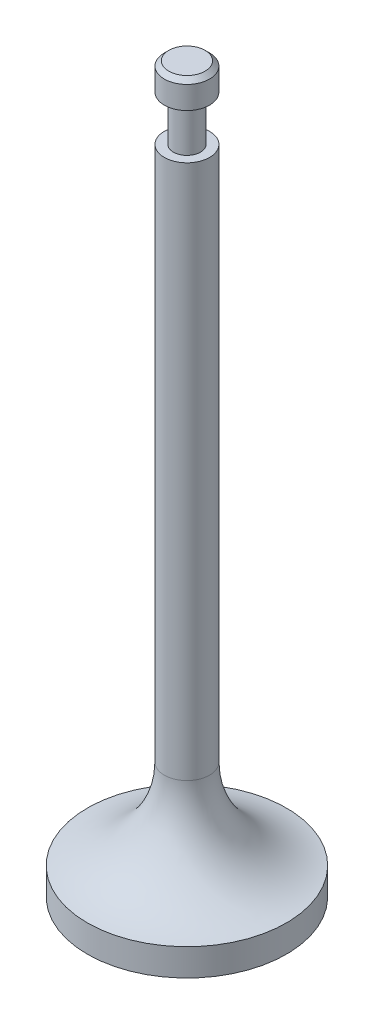
ISO-10303-21;
HEADER;
FILE_DESCRIPTION(('STEP AP214'),'2;1');
FILE_NAME('part.step','',(''),(''),'','','');
FILE_SCHEMA(('AUTOMOTIVE_DESIGN { 1 0 10303 214 1 1 1 1 }'));
ENDSEC;
DATA;
#1=APPLICATION_CONTEXT('core data for automotive mechanical design processes');
#2=APPLICATION_PROTOCOL_DEFINITION('international standard','automotive_design',2000,#1);
#3=PRODUCT_CONTEXT('',#1,'mechanical');
#4=PRODUCT('Part','Part','',(#3));
#5=PRODUCT_RELATED_PRODUCT_CATEGORY('part','',(#4));
#6=PRODUCT_DEFINITION_FORMATION('','',#4);
#7=PRODUCT_DEFINITION_CONTEXT('part definition',#1,'design');
#8=PRODUCT_DEFINITION('design','',#6,#7);
#9=PRODUCT_DEFINITION_SHAPE('','',#8);
#10=(LENGTH_UNIT() NAMED_UNIT(*) SI_UNIT(.MILLI.,.METRE.));
#11=(NAMED_UNIT(*) PLANE_ANGLE_UNIT() SI_UNIT($,.RADIAN.));
#12=(NAMED_UNIT(*) SI_UNIT($,.STERADIAN.) SOLID_ANGLE_UNIT());
#13=UNCERTAINTY_MEASURE_WITH_UNIT(LENGTH_MEASURE(1.E-05),#10,'distance_accuracy_value','');
#14=(GEOMETRIC_REPRESENTATION_CONTEXT(3) GLOBAL_UNCERTAINTY_ASSIGNED_CONTEXT((#13)) GLOBAL_UNIT_ASSIGNED_CONTEXT((#10,
#11,#12)) REPRESENTATION_CONTEXT('',''));
#15=CARTESIAN_POINT('',(0.,0.,0.));
#16=DIRECTION('',(0.,0.,1.));
#17=DIRECTION('',(1.,0.,0.));
#18=AXIS2_PLACEMENT_3D('',#15,#16,#17);
#19=CARTESIAN_POINT('',(0.,0.,-2.50000000000002));
#20=DIRECTION('',(0.,-1.,0.));
#21=DIRECTION('',(0.,0.,-1.));
#22=AXIS2_PLACEMENT_3D('',#19,#20,#21);
#23=PLANE('',#22);
#24=CARTESIAN_POINT('',(0.,0.,0.));
#25=DIRECTION('',(0.,-1.,0.));
#26=DIRECTION('',(0.,0.,-1.));
#27=AXIS2_PLACEMENT_3D('',#24,#25,#26);
#28=CIRCLE('',#27,2.00000000000002);
#29=CARTESIAN_POINT('',(0.,0.,-2.00000000000002));
#30=VERTEX_POINT('',#29);
#31=EDGE_CURVE('E42',#30,#30,#28,.F.);
#32=ORIENTED_EDGE('',*,*,#31,.T.);
#33=EDGE_LOOP('',(#32));
#34=FACE_BOUND('',#33,.T.);
#35=ADVANCED_FACE('F31',(#34),#23,.F.);
#36=CARTESIAN_POINT('',(0.,-80.,0.));
#37=DIRECTION('',(0.,1.,0.));
#38=DIRECTION('',(0.,0.,1.));
#39=AXIS2_PLACEMENT_3D('',#36,#37,#38);
#40=PLANE('',#39);
#41=CARTESIAN_POINT('',(0.,-80.,0.));
#42=DIRECTION('',(0.,1.,0.));
#43=DIRECTION('',(0.,0.,1.));
#44=AXIS2_PLACEMENT_3D('',#41,#42,#43);
#45=CIRCLE('',#44,11.);
#46=CARTESIAN_POINT('',(0.,-80.,11.));
#47=VERTEX_POINT('',#46);
#48=EDGE_CURVE('E46',#47,#47,#45,.T.);
#49=ORIENTED_EDGE('',*,*,#48,.F.);
#50=EDGE_LOOP('',(#49));
#51=FACE_BOUND('',#50,.T.);
#52=ADVANCED_FACE('F94',(#51),#40,.F.);
#53=CARTESIAN_POINT('',(0.,0.,0.));
#54=DIRECTION('',(0.,1.,0.));
#55=DIRECTION('',(0.,0.,1.));
#56=AXIS2_PLACEMENT_3D('',#53,#54,#55);
#57=CYLINDRICAL_SURFACE('',#56,11.);
#58=CARTESIAN_POINT('',(0.,-77.,0.));
#59=DIRECTION('',(0.,1.,0.));
#60=DIRECTION('',(0.,0.,1.));
#61=AXIS2_PLACEMENT_3D('',#58,#59,#60);
#62=CIRCLE('',#61,11.);
#63=CARTESIAN_POINT('',(0.,-77.,11.));
#64=VERTEX_POINT('',#63);
#65=EDGE_CURVE('E51',#64,#64,#62,.T.);
#66=ORIENTED_EDGE('',*,*,#65,.F.);
#67=EDGE_LOOP('',(#66));
#68=FACE_BOUND('',#67,.T.);
#69=ORIENTED_EDGE('',*,*,#48,.T.);
#70=EDGE_LOOP('',(#69));
#71=FACE_BOUND('',#70,.T.);
#72=ADVANCED_FACE('F89',(#68,#71),#57,.T.);
#73=CARTESIAN_POINT('',(0.,0.,0.));
#74=DIRECTION('',(0.,1.,0.));
#75=DIRECTION('',(0.,0.,1.));
#76=AXIS2_PLACEMENT_3D('',#73,#74,#75);
#77=CYLINDRICAL_SURFACE('',#76,2.50000000000001);
#78=CARTESIAN_POINT('',(0.,-67.1131400333574,0.));
#79=DIRECTION('',(0.,-1.,0.));
#80=DIRECTION('',(0.,0.,-1.));
#81=AXIS2_PLACEMENT_3D('',#78,#79,#80);
#82=CIRCLE('',#81,2.50000000000001);
#83=CARTESIAN_POINT('',(0.,-67.1131400333574,-2.50000000000001));
#84=VERTEX_POINT('',#83);
#85=EDGE_CURVE('E10',#84,#84,#82,.F.);
#86=ORIENTED_EDGE('',*,*,#85,.T.);
#87=EDGE_LOOP('',(#86));
#88=FACE_BOUND('',#87,.T.);
#89=CARTESIAN_POINT('',(0.,-8.,0.));
#90=DIRECTION('',(0.,1.,0.));
#91=DIRECTION('',(0.,0.,1.));
#92=AXIS2_PLACEMENT_3D('',#89,#90,#91);
#93=CIRCLE('',#92,2.50000000000001);
#94=CARTESIAN_POINT('',(0.,-8.,2.50000000000001));
#95=VERTEX_POINT('',#94);
#96=EDGE_CURVE('E54',#95,#95,#93,.T.);
#97=ORIENTED_EDGE('',*,*,#96,.F.);
#98=EDGE_LOOP('',(#97));
#99=FACE_BOUND('',#98,.T.);
#100=ADVANCED_FACE('F84',(#88,#99),#77,.T.);
#101=CARTESIAN_POINT('',(0.,-8.,-2.50000000000001));
#102=DIRECTION('',(0.,-1.,0.));
#103=DIRECTION('',(0.,0.,-1.));
#104=AXIS2_PLACEMENT_3D('',#101,#102,#103);
#105=PLANE('',#104);
#106=CARTESIAN_POINT('',(0.,-8.,0.));
#107=DIRECTION('',(0.,1.,0.));
#108=DIRECTION('',(0.,0.,1.));
#109=AXIS2_PLACEMENT_3D('',#106,#107,#108);
#110=CIRCLE('',#109,1.49570644121977);
#111=CARTESIAN_POINT('',(0.,-8.,1.49570644121977));
#112=VERTEX_POINT('',#111);
#113=EDGE_CURVE('E57',#112,#112,#110,.T.);
#114=ORIENTED_EDGE('',*,*,#113,.F.);
#115=EDGE_LOOP('',(#114));
#116=FACE_BOUND('',#115,.T.);
#117=ORIENTED_EDGE('',*,*,#96,.T.);
#118=EDGE_LOOP('',(#117));
#119=FACE_BOUND('',#118,.T.);
#120=ADVANCED_FACE('F78',(#116,#119),#105,.F.);
#121=CARTESIAN_POINT('',(0.,0.,0.));
#122=DIRECTION('',(0.,1.,0.));
#123=DIRECTION('',(0.,0.,1.));
#124=AXIS2_PLACEMENT_3D('',#121,#122,#123);
#125=CYLINDRICAL_SURFACE('',#124,1.49570644121977);
#126=CARTESIAN_POINT('',(0.,-3.,0.));
#127=DIRECTION('',(0.,1.,0.));
#128=DIRECTION('',(0.,0.,1.));
#129=AXIS2_PLACEMENT_3D('',#126,#127,#128);
#130=CIRCLE('',#129,1.49570644121977);
#131=CARTESIAN_POINT('',(0.,-3.,1.49570644121977));
#132=VERTEX_POINT('',#131);
#133=EDGE_CURVE('E60',#132,#132,#130,.T.);
#134=ORIENTED_EDGE('',*,*,#133,.F.);
#135=EDGE_LOOP('',(#134));
#136=FACE_BOUND('',#135,.T.);
#137=ORIENTED_EDGE('',*,*,#113,.T.);
#138=EDGE_LOOP('',(#137));
#139=FACE_BOUND('',#138,.T.);
#140=ADVANCED_FACE('F72',(#136,#139),#125,.T.);
#141=CARTESIAN_POINT('',(0.,-3.,-1.49570644121977));
#142=DIRECTION('',(0.,1.,0.));
#143=DIRECTION('',(0.,0.,1.));
#144=AXIS2_PLACEMENT_3D('',#141,#142,#143);
#145=PLANE('',#144);
#146=CARTESIAN_POINT('',(0.,-3.,0.));
#147=DIRECTION('',(0.,1.,0.));
#148=DIRECTION('',(0.,0.,1.));
#149=AXIS2_PLACEMENT_3D('',#146,#147,#148);
#150=CIRCLE('',#149,2.50000000000002);
#151=CARTESIAN_POINT('',(0.,-3.,2.50000000000002));
#152=VERTEX_POINT('',#151);
#153=EDGE_CURVE('E63',#152,#152,#150,.T.);
#154=ORIENTED_EDGE('',*,*,#153,.F.);
#155=EDGE_LOOP('',(#154));
#156=FACE_BOUND('',#155,.T.);
#157=ORIENTED_EDGE('',*,*,#133,.T.);
#158=EDGE_LOOP('',(#157));
#159=FACE_BOUND('',#158,.T.);
#160=ADVANCED_FACE('F69',(#156,#159),#145,.F.);
#161=CARTESIAN_POINT('',(0.,0.,0.));
#162=DIRECTION('',(0.,1.,0.));
#163=DIRECTION('',(0.,0.,1.));
#164=AXIS2_PLACEMENT_3D('',#161,#162,#163);
#165=CYLINDRICAL_SURFACE('',#164,2.50000000000002);
#166=CARTESIAN_POINT('',(0.,-0.500000000000005,0.));
#167=DIRECTION('',(0.,-1.,0.));
#168=DIRECTION('',(0.,0.,-1.));
#169=AXIS2_PLACEMENT_3D('',#166,#167,#168);
#170=CIRCLE('',#169,2.50000000000002);
#171=CARTESIAN_POINT('',(0.,-0.500000000000005,-2.50000000000002));
#172=VERTEX_POINT('',#171);
#173=EDGE_CURVE('E38',#172,#172,#170,.T.);
#174=ORIENTED_EDGE('',*,*,#173,.T.);
#175=EDGE_LOOP('',(#174));
#176=FACE_BOUND('',#175,.T.);
#177=ORIENTED_EDGE('',*,*,#153,.T.);
#178=EDGE_LOOP('',(#177));
#179=FACE_BOUND('',#178,.T.);
#180=ADVANCED_FACE('F67',(#176,#179),#165,.T.);
#181=CARTESIAN_POINT('',(0.,0.,0.));
#182=DIRECTION('',(0.,-1.,0.));
#183=DIRECTION('',(0.,0.,-1.));
#184=AXIS2_PLACEMENT_3D('',#181,#182,#183);
#185=CONICAL_SURFACE('',#184,2.00000000000002,0.78539816339744);
#186=ORIENTED_EDGE('',*,*,#173,.F.);
#187=EDGE_LOOP('',(#186));
#188=FACE_BOUND('',#187,.T.);
#189=ORIENTED_EDGE('',*,*,#31,.F.);
#190=EDGE_LOOP('',(#189));
#191=FACE_BOUND('',#190,.T.);
#192=ADVANCED_FACE('F105',(#188,#191),#185,.T.);
#193=CARTESIAN_POINT('',(0.,-67.1131400333574,0.));
#194=DIRECTION('',(0.,-1.,0.));
#195=DIRECTION('',(0.,0.,-1.));
#196=AXIS2_PLACEMENT_3D('',#193,#194,#195);
#197=TOROIDAL_SURFACE('',#196,12.5,10.);
#198=ORIENTED_EDGE('',*,*,#65,.T.);
#199=EDGE_LOOP('',(#198));
#200=FACE_BOUND('',#199,.T.);
#201=ORIENTED_EDGE('',*,*,#85,.F.);
#202=EDGE_LOOP('',(#201));
#203=FACE_BOUND('',#202,.T.);
#204=ADVANCED_FACE('F33',(#200,#203),#197,.F.);
#205=CLOSED_SHELL('',(#35,#52,#72,#100,#120,#140,#160,#180,#192,#204));
#206=MANIFOLD_SOLID_BREP('B2',#205);
#207=ADVANCED_BREP_SHAPE_REPRESENTATION('',(#18,#206),#14);
#208=SHAPE_DEFINITION_REPRESENTATION(#9,#207);
ENDSEC;
END-ISO-10303-21;
